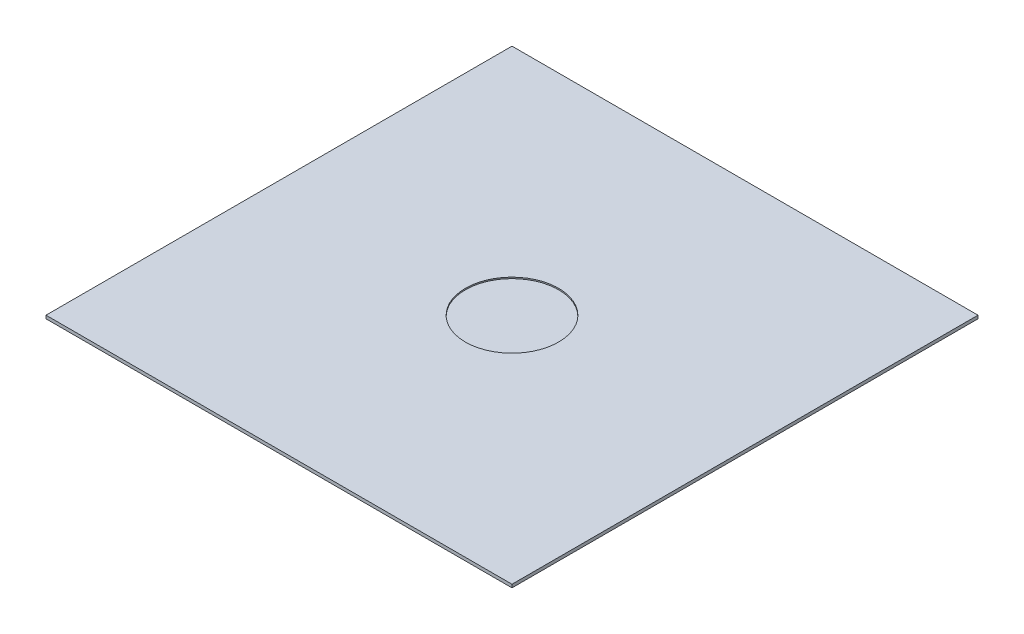
ISO-10303-21;
HEADER;
FILE_DESCRIPTION(('STEP AP214'),'2;1');
FILE_NAME('part.step','',(''),(''),'','','');
FILE_SCHEMA(('AUTOMOTIVE_DESIGN { 1 0 10303 214 1 1 1 1 }'));
ENDSEC;
DATA;
#1=APPLICATION_CONTEXT('core data for automotive mechanical design processes');
#2=APPLICATION_PROTOCOL_DEFINITION('international standard','automotive_design',2000,#1);
#3=PRODUCT_CONTEXT('',#1,'mechanical');
#4=PRODUCT('Part','Part','',(#3));
#5=PRODUCT_RELATED_PRODUCT_CATEGORY('part','',(#4));
#6=PRODUCT_DEFINITION_FORMATION('','',#4);
#7=PRODUCT_DEFINITION_CONTEXT('part definition',#1,'design');
#8=PRODUCT_DEFINITION('design','',#6,#7);
#9=PRODUCT_DEFINITION_SHAPE('','',#8);
#10=(LENGTH_UNIT() NAMED_UNIT(*) SI_UNIT(.MILLI.,.METRE.));
#11=(NAMED_UNIT(*) PLANE_ANGLE_UNIT() SI_UNIT($,.RADIAN.));
#12=(NAMED_UNIT(*) SI_UNIT($,.STERADIAN.) SOLID_ANGLE_UNIT());
#13=UNCERTAINTY_MEASURE_WITH_UNIT(LENGTH_MEASURE(1.E-05),#10,'distance_accuracy_value','');
#14=(GEOMETRIC_REPRESENTATION_CONTEXT(3) GLOBAL_UNCERTAINTY_ASSIGNED_CONTEXT((#13)) GLOBAL_UNIT_ASSIGNED_CONTEXT((#10,
#11,#12)) REPRESENTATION_CONTEXT('',''));
#15=CARTESIAN_POINT('',(0.,0.,0.));
#16=DIRECTION('',(0.,0.,1.));
#17=DIRECTION('',(1.,0.,0.));
#18=AXIS2_PLACEMENT_3D('',#15,#16,#17);
#19=CARTESIAN_POINT('',(12.5,0.17,12.5));
#20=DIRECTION('',(-1.,0.,0.));
#21=DIRECTION('',(0.,0.,1.));
#22=AXIS2_PLACEMENT_3D('',#19,#20,#21);
#23=PLANE('',#22);
#24=DIRECTION('',(0.,0.,-1.));
#25=VECTOR('',#24,1.);
#26=CARTESIAN_POINT('',(12.5,0.,12.5));
#27=LINE('',#26,#25);
#28=CARTESIAN_POINT('',(12.5,0.,12.5));
#29=VERTEX_POINT('',#28);
#30=CARTESIAN_POINT('',(12.5,0.,-12.5));
#31=VERTEX_POINT('',#30);
#32=EDGE_CURVE('E100',#29,#31,#27,.T.);
#33=ORIENTED_EDGE('',*,*,#32,.T.);
#34=DIRECTION('',(0.,-1.,0.));
#35=VECTOR('',#34,1.);
#36=CARTESIAN_POINT('',(12.5,0.17,-12.5));
#37=LINE('',#36,#35);
#38=CARTESIAN_POINT('',(12.5,0.17,-12.5));
#39=VERTEX_POINT('',#38);
#40=EDGE_CURVE('E11',#39,#31,#37,.T.);
#41=ORIENTED_EDGE('',*,*,#40,.F.);
#42=DIRECTION('',(0.,0.,-1.));
#43=VECTOR('',#42,1.);
#44=CARTESIAN_POINT('',(12.5,0.17,12.5));
#45=LINE('',#44,#43);
#46=CARTESIAN_POINT('',(12.5,0.17,12.5));
#47=VERTEX_POINT('',#46);
#48=EDGE_CURVE('E88',#47,#39,#45,.T.);
#49=ORIENTED_EDGE('',*,*,#48,.F.);
#50=DIRECTION('',(0.,-1.,0.));
#51=VECTOR('',#50,1.);
#52=CARTESIAN_POINT('',(12.5,0.17,12.5));
#53=LINE('',#52,#51);
#54=EDGE_CURVE('E96',#47,#29,#53,.T.);
#55=ORIENTED_EDGE('',*,*,#54,.T.);
#56=EDGE_LOOP('',(#33,#41,#49,#55));
#57=FACE_BOUND('',#56,.T.);
#58=ADVANCED_FACE('F37',(#57),#23,.F.);
#59=CARTESIAN_POINT('',(-12.5,0.17,-12.5));
#60=DIRECTION('',(0.,0.,1.));
#61=DIRECTION('',(1.,0.,0.));
#62=AXIS2_PLACEMENT_3D('',#59,#60,#61);
#63=PLANE('',#62);
#64=DIRECTION('',(-1.,0.,0.));
#65=VECTOR('',#64,1.);
#66=CARTESIAN_POINT('',(-12.5,0.,-12.5));
#67=LINE('',#66,#65);
#68=CARTESIAN_POINT('',(-12.5,0.,-12.5));
#69=VERTEX_POINT('',#68);
#70=EDGE_CURVE('E92',#31,#69,#67,.T.);
#71=ORIENTED_EDGE('',*,*,#70,.T.);
#72=DIRECTION('',(0.,-1.,0.));
#73=VECTOR('',#72,1.);
#74=CARTESIAN_POINT('',(-12.5,0.17,-12.5));
#75=LINE('',#74,#73);
#76=CARTESIAN_POINT('',(-12.5,0.17,-12.5));
#77=VERTEX_POINT('',#76);
#78=EDGE_CURVE('E45',#77,#69,#75,.T.);
#79=ORIENTED_EDGE('',*,*,#78,.F.);
#80=DIRECTION('',(-1.,0.,0.));
#81=VECTOR('',#80,1.);
#82=CARTESIAN_POINT('',(-12.5,0.17,-12.5));
#83=LINE('',#82,#81);
#84=EDGE_CURVE('E83',#39,#77,#83,.T.);
#85=ORIENTED_EDGE('',*,*,#84,.F.);
#86=ORIENTED_EDGE('',*,*,#40,.T.);
#87=EDGE_LOOP('',(#71,#79,#85,#86));
#88=FACE_BOUND('',#87,.T.);
#89=ADVANCED_FACE('F91',(#88),#63,.F.);
#90=CARTESIAN_POINT('',(-12.5,0.17,12.5));
#91=DIRECTION('',(1.,0.,0.));
#92=DIRECTION('',(0.,0.,-1.));
#93=AXIS2_PLACEMENT_3D('',#90,#91,#92);
#94=PLANE('',#93);
#95=DIRECTION('',(0.,0.,1.));
#96=VECTOR('',#95,1.);
#97=CARTESIAN_POINT('',(-12.5,0.,12.5));
#98=LINE('',#97,#96);
#99=CARTESIAN_POINT('',(-12.5,0.,12.5));
#100=VERTEX_POINT('',#99);
#101=EDGE_CURVE('E70',#69,#100,#98,.T.);
#102=ORIENTED_EDGE('',*,*,#101,.T.);
#103=DIRECTION('',(0.,-1.,0.));
#104=VECTOR('',#103,1.);
#105=CARTESIAN_POINT('',(-12.5,0.17,12.5));
#106=LINE('',#105,#104);
#107=CARTESIAN_POINT('',(-12.5,0.17,12.5));
#108=VERTEX_POINT('',#107);
#109=EDGE_CURVE('E93',#108,#100,#106,.T.);
#110=ORIENTED_EDGE('',*,*,#109,.F.);
#111=DIRECTION('',(0.,0.,1.));
#112=VECTOR('',#111,1.);
#113=CARTESIAN_POINT('',(-12.5,0.17,12.5));
#114=LINE('',#113,#112);
#115=EDGE_CURVE('E86',#77,#108,#114,.T.);
#116=ORIENTED_EDGE('',*,*,#115,.F.);
#117=ORIENTED_EDGE('',*,*,#78,.T.);
#118=EDGE_LOOP('',(#102,#110,#116,#117));
#119=FACE_BOUND('',#118,.T.);
#120=ADVANCED_FACE('F94',(#119),#94,.F.);
#121=CARTESIAN_POINT('',(-12.5,0.17,12.5));
#122=DIRECTION('',(0.,0.,-1.));
#123=DIRECTION('',(-1.,0.,0.));
#124=AXIS2_PLACEMENT_3D('',#121,#122,#123);
#125=PLANE('',#124);
#126=DIRECTION('',(1.,0.,0.));
#127=VECTOR('',#126,1.);
#128=CARTESIAN_POINT('',(-12.5,0.,12.5));
#129=LINE('',#128,#127);
#130=EDGE_CURVE('E76',#100,#29,#129,.T.);
#131=ORIENTED_EDGE('',*,*,#130,.T.);
#132=ORIENTED_EDGE('',*,*,#54,.F.);
#133=DIRECTION('',(1.,0.,0.));
#134=VECTOR('',#133,1.);
#135=CARTESIAN_POINT('',(-12.5,0.17,12.5));
#136=LINE('',#135,#134);
#137=EDGE_CURVE('E53',#108,#47,#136,.T.);
#138=ORIENTED_EDGE('',*,*,#137,.F.);
#139=ORIENTED_EDGE('',*,*,#109,.T.);
#140=EDGE_LOOP('',(#131,#132,#138,#139));
#141=FACE_BOUND('',#140,.T.);
#142=ADVANCED_FACE('F108',(#141),#125,.F.);
#143=CARTESIAN_POINT('',(0.,0.17,0.));
#144=DIRECTION('',(0.,-1.,0.));
#145=DIRECTION('',(0.,0.,-1.));
#146=AXIS2_PLACEMENT_3D('',#143,#144,#145);
#147=PLANE('',#146);
#148=CARTESIAN_POINT('',(0.,0.17,0.));
#149=DIRECTION('',(0.,1.,0.));
#150=DIRECTION('',(0.,0.,1.));
#151=AXIS2_PLACEMENT_3D('',#148,#149,#150);
#152=CIRCLE('',#151,2.5);
#153=CARTESIAN_POINT('',(0.,0.17,2.5));
#154=VERTEX_POINT('',#153);
#155=EDGE_CURVE('E114',#154,#154,#152,.T.);
#156=ORIENTED_EDGE('',*,*,#155,.F.);
#157=EDGE_LOOP('',(#156));
#158=FACE_BOUND('',#157,.T.);
#159=ORIENTED_EDGE('',*,*,#48,.T.);
#160=ORIENTED_EDGE('',*,*,#84,.T.);
#161=ORIENTED_EDGE('',*,*,#115,.T.);
#162=ORIENTED_EDGE('',*,*,#137,.T.);
#163=EDGE_LOOP('',(#159,#160,#161,#162));
#164=FACE_BOUND('',#163,.T.);
#165=ADVANCED_FACE('F84',(#158,#164),#147,.F.);
#166=CARTESIAN_POINT('',(0.,0.,0.));
#167=DIRECTION('',(0.,-1.,0.));
#168=DIRECTION('',(0.,0.,-1.));
#169=AXIS2_PLACEMENT_3D('',#166,#167,#168);
#170=PLANE('',#169);
#171=ORIENTED_EDGE('',*,*,#32,.F.);
#172=ORIENTED_EDGE('',*,*,#130,.F.);
#173=ORIENTED_EDGE('',*,*,#101,.F.);
#174=ORIENTED_EDGE('',*,*,#70,.F.);
#175=EDGE_LOOP('',(#171,#172,#173,#174));
#176=FACE_BOUND('',#175,.T.);
#177=ADVANCED_FACE('F111',(#176),#170,.T.);
#178=CARTESIAN_POINT('',(0.,0.1,0.));
#179=DIRECTION('',(0.,1.,0.));
#180=DIRECTION('',(0.,0.,1.));
#181=AXIS2_PLACEMENT_3D('',#178,#179,#180);
#182=CYLINDRICAL_SURFACE('',#181,2.5);
#183=CARTESIAN_POINT('',(0.,0.1,0.));
#184=DIRECTION('',(0.,1.,0.));
#185=DIRECTION('',(0.,0.,1.));
#186=AXIS2_PLACEMENT_3D('',#183,#184,#185);
#187=CIRCLE('',#186,2.5);
#188=CARTESIAN_POINT('',(0.,0.1,2.5));
#189=VERTEX_POINT('',#188);
#190=EDGE_CURVE('E103',#189,#189,#187,.T.);
#191=ORIENTED_EDGE('',*,*,#190,.F.);
#192=EDGE_LOOP('',(#191));
#193=FACE_BOUND('',#192,.T.);
#194=ORIENTED_EDGE('',*,*,#155,.T.);
#195=EDGE_LOOP('',(#194));
#196=FACE_BOUND('',#195,.T.);
#197=ADVANCED_FACE('F122',(#193,#196),#182,.F.);
#198=CARTESIAN_POINT('',(0.,0.1,0.));
#199=DIRECTION('',(0.,1.,0.));
#200=DIRECTION('',(0.,0.,1.));
#201=AXIS2_PLACEMENT_3D('',#198,#199,#200);
#202=PLANE('',#201);
#203=ORIENTED_EDGE('',*,*,#190,.T.);
#204=EDGE_LOOP('',(#203));
#205=FACE_BOUND('',#204,.T.);
#206=ADVANCED_FACE('F120',(#205),#202,.T.);
#207=CLOSED_SHELL('',(#58,#89,#120,#142,#165,#177,#197,#206));
#208=MANIFOLD_SOLID_BREP('B2',#207);
#209=ADVANCED_BREP_SHAPE_REPRESENTATION('',(#18,#208),#14);
#210=SHAPE_DEFINITION_REPRESENTATION(#9,#209);
ENDSEC;
END-ISO-10303-21;
